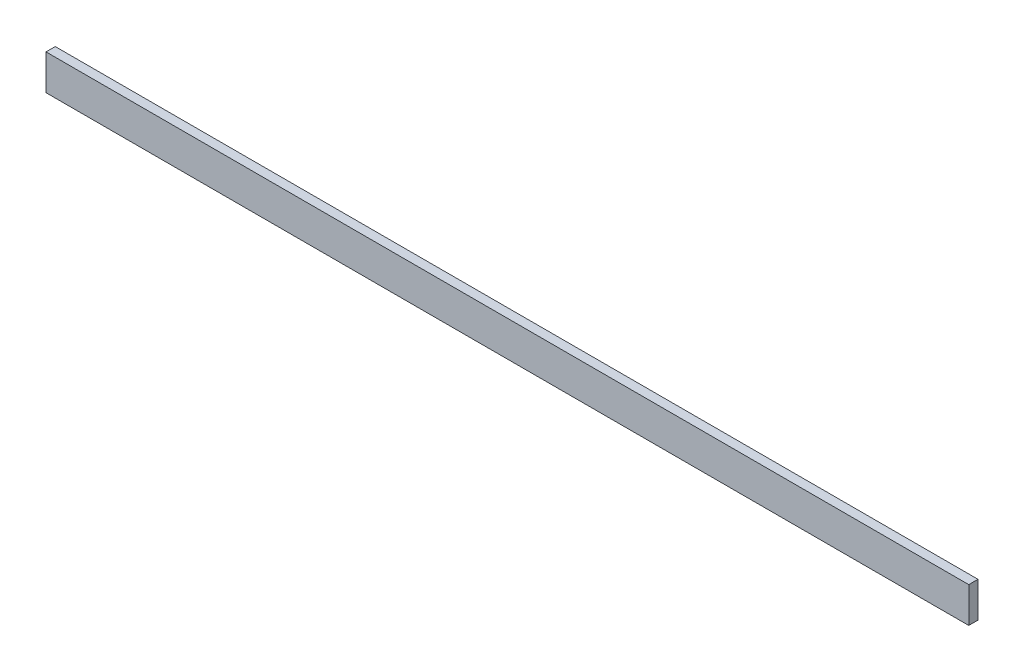
ISO-10303-21;
HEADER;
FILE_DESCRIPTION(('STEP AP214'),'2;1');
FILE_NAME('part.step','',(''),(''),'','','');
FILE_SCHEMA(('AUTOMOTIVE_DESIGN { 1 0 10303 214 1 1 1 1 }'));
ENDSEC;
DATA;
#1=APPLICATION_CONTEXT('core data for automotive mechanical design processes');
#2=APPLICATION_PROTOCOL_DEFINITION('international standard','automotive_design',2000,#1);
#3=PRODUCT_CONTEXT('',#1,'mechanical');
#4=PRODUCT('Part','Part','',(#3));
#5=PRODUCT_RELATED_PRODUCT_CATEGORY('part','',(#4));
#6=PRODUCT_DEFINITION_FORMATION('','',#4);
#7=PRODUCT_DEFINITION_CONTEXT('part definition',#1,'design');
#8=PRODUCT_DEFINITION('design','',#6,#7);
#9=PRODUCT_DEFINITION_SHAPE('','',#8);
#10=(LENGTH_UNIT() NAMED_UNIT(*) SI_UNIT(.MILLI.,.METRE.));
#11=(NAMED_UNIT(*) PLANE_ANGLE_UNIT() SI_UNIT($,.RADIAN.));
#12=(NAMED_UNIT(*) SI_UNIT($,.STERADIAN.) SOLID_ANGLE_UNIT());
#13=UNCERTAINTY_MEASURE_WITH_UNIT(LENGTH_MEASURE(1.E-05),#10,'distance_accuracy_value','');
#14=(GEOMETRIC_REPRESENTATION_CONTEXT(3) GLOBAL_UNCERTAINTY_ASSIGNED_CONTEXT((#13)) GLOBAL_UNIT_ASSIGNED_CONTEXT((#10,
#11,#12)) REPRESENTATION_CONTEXT('',''));
#15=CARTESIAN_POINT('',(0.,0.,0.));
#16=DIRECTION('',(0.,0.,1.));
#17=DIRECTION('',(1.,0.,0.));
#18=AXIS2_PLACEMENT_3D('',#15,#16,#17);
#19=CARTESIAN_POINT('',(0.,38.2926221353073,10.));
#20=DIRECTION('',(1.,0.,0.));
#21=DIRECTION('',(0.,0.,-1.));
#22=AXIS2_PLACEMENT_3D('',#19,#20,#21);
#23=PLANE('',#22);
#24=DIRECTION('',(0.,-1.,0.));
#25=VECTOR('',#24,1.);
#26=CARTESIAN_POINT('',(0.,38.2926221353073,0.));
#27=LINE('',#26,#25);
#28=CARTESIAN_POINT('',(0.,38.2926221353073,0.));
#29=VERTEX_POINT('',#28);
#30=CARTESIAN_POINT('',(0.,0.,0.));
#31=VERTEX_POINT('',#30);
#32=EDGE_CURVE('E113',#29,#31,#27,.T.);
#33=ORIENTED_EDGE('',*,*,#32,.T.);
#34=DIRECTION('',(0.,0.,-1.));
#35=VECTOR('',#34,1.);
#36=CARTESIAN_POINT('',(0.,0.,10.));
#37=LINE('',#36,#35);
#38=CARTESIAN_POINT('',(0.,0.,10.));
#39=VERTEX_POINT('',#38);
#40=EDGE_CURVE('E11',#39,#31,#37,.T.);
#41=ORIENTED_EDGE('',*,*,#40,.F.);
#42=DIRECTION('',(0.,-1.,0.));
#43=VECTOR('',#42,1.);
#44=CARTESIAN_POINT('',(0.,38.2926221353073,10.));
#45=LINE('',#44,#43);
#46=CARTESIAN_POINT('',(0.,38.2926221353073,10.));
#47=VERTEX_POINT('',#46);
#48=EDGE_CURVE('E97',#47,#39,#45,.T.);
#49=ORIENTED_EDGE('',*,*,#48,.F.);
#50=DIRECTION('',(0.,0.,-1.));
#51=VECTOR('',#50,1.);
#52=CARTESIAN_POINT('',(0.,38.2926221353073,10.));
#53=LINE('',#52,#51);
#54=EDGE_CURVE('E109',#47,#29,#53,.T.);
#55=ORIENTED_EDGE('',*,*,#54,.T.);
#56=EDGE_LOOP('',(#33,#41,#49,#55));
#57=FACE_BOUND('',#56,.T.);
#58=ADVANCED_FACE('F45',(#57),#23,.F.);
#59=CARTESIAN_POINT('',(0.,0.,10.));
#60=DIRECTION('',(0.,1.,0.));
#61=DIRECTION('',(0.,0.,1.));
#62=AXIS2_PLACEMENT_3D('',#59,#60,#61);
#63=PLANE('',#62);
#64=DIRECTION('',(1.,0.,0.));
#65=VECTOR('',#64,1.);
#66=CARTESIAN_POINT('',(0.,0.,0.));
#67=LINE('',#66,#65);
#68=CARTESIAN_POINT('',(998.757088830134,0.,0.));
#69=VERTEX_POINT('',#68);
#70=EDGE_CURVE('E102',#31,#69,#67,.T.);
#71=ORIENTED_EDGE('',*,*,#70,.T.);
#72=DIRECTION('',(0.,0.,-1.));
#73=VECTOR('',#72,1.);
#74=CARTESIAN_POINT('',(998.757088830134,0.,10.));
#75=LINE('',#74,#73);
#76=CARTESIAN_POINT('',(998.757088830134,0.,10.));
#77=VERTEX_POINT('',#76);
#78=EDGE_CURVE('E54',#77,#69,#75,.T.);
#79=ORIENTED_EDGE('',*,*,#78,.F.);
#80=DIRECTION('',(1.,0.,0.));
#81=VECTOR('',#80,1.);
#82=CARTESIAN_POINT('',(0.,0.,10.));
#83=LINE('',#82,#81);
#84=EDGE_CURVE('E92',#39,#77,#83,.T.);
#85=ORIENTED_EDGE('',*,*,#84,.F.);
#86=ORIENTED_EDGE('',*,*,#40,.T.);
#87=EDGE_LOOP('',(#71,#79,#85,#86));
#88=FACE_BOUND('',#87,.T.);
#89=ADVANCED_FACE('F101',(#88),#63,.F.);
#90=CARTESIAN_POINT('',(998.757088830134,0.,10.));
#91=DIRECTION('',(-1.,0.,0.));
#92=DIRECTION('',(0.,0.,1.));
#93=AXIS2_PLACEMENT_3D('',#90,#91,#92);
#94=PLANE('',#93);
#95=DIRECTION('',(0.,1.,0.));
#96=VECTOR('',#95,1.);
#97=CARTESIAN_POINT('',(998.757088830134,0.,0.));
#98=LINE('',#97,#96);
#99=CARTESIAN_POINT('',(998.757088830134,38.2926221353073,0.));
#100=VERTEX_POINT('',#99);
#101=EDGE_CURVE('E79',#69,#100,#98,.T.);
#102=ORIENTED_EDGE('',*,*,#101,.T.);
#103=DIRECTION('',(0.,0.,-1.));
#104=VECTOR('',#103,1.);
#105=CARTESIAN_POINT('',(998.757088830134,38.2926221353073,10.));
#106=LINE('',#105,#104);
#107=CARTESIAN_POINT('',(998.757088830134,38.2926221353073,10.));
#108=VERTEX_POINT('',#107);
#109=EDGE_CURVE('E104',#108,#100,#106,.T.);
#110=ORIENTED_EDGE('',*,*,#109,.F.);
#111=DIRECTION('',(0.,1.,0.));
#112=VECTOR('',#111,1.);
#113=CARTESIAN_POINT('',(998.757088830134,0.,10.));
#114=LINE('',#113,#112);
#115=EDGE_CURVE('E95',#77,#108,#114,.T.);
#116=ORIENTED_EDGE('',*,*,#115,.F.);
#117=ORIENTED_EDGE('',*,*,#78,.T.);
#118=EDGE_LOOP('',(#102,#110,#116,#117));
#119=FACE_BOUND('',#118,.T.);
#120=ADVANCED_FACE('F105',(#119),#94,.F.);
#121=CARTESIAN_POINT('',(998.757088830134,38.2926221353073,10.));
#122=DIRECTION('',(0.,-1.,0.));
#123=DIRECTION('',(0.,0.,-1.));
#124=AXIS2_PLACEMENT_3D('',#121,#122,#123);
#125=PLANE('',#124);
#126=DIRECTION('',(-1.,0.,0.));
#127=VECTOR('',#126,1.);
#128=CARTESIAN_POINT('',(998.757088830134,38.2926221353073,0.));
#129=LINE('',#128,#127);
#130=EDGE_CURVE('E85',#100,#29,#129,.T.);
#131=ORIENTED_EDGE('',*,*,#130,.T.);
#132=ORIENTED_EDGE('',*,*,#54,.F.);
#133=DIRECTION('',(-1.,0.,0.));
#134=VECTOR('',#133,1.);
#135=CARTESIAN_POINT('',(998.757088830134,38.2926221353073,10.));
#136=LINE('',#135,#134);
#137=EDGE_CURVE('E62',#108,#47,#136,.T.);
#138=ORIENTED_EDGE('',*,*,#137,.F.);
#139=ORIENTED_EDGE('',*,*,#109,.T.);
#140=EDGE_LOOP('',(#131,#132,#138,#139));
#141=FACE_BOUND('',#140,.T.);
#142=ADVANCED_FACE('F126',(#141),#125,.F.);
#143=CARTESIAN_POINT('',(0.,0.,10.));
#144=DIRECTION('',(0.,0.,1.));
#145=DIRECTION('',(1.,0.,0.));
#146=AXIS2_PLACEMENT_3D('',#143,#144,#145);
#147=PLANE('',#146);
#148=ORIENTED_EDGE('',*,*,#48,.T.);
#149=ORIENTED_EDGE('',*,*,#84,.T.);
#150=ORIENTED_EDGE('',*,*,#115,.T.);
#151=ORIENTED_EDGE('',*,*,#137,.T.);
#152=EDGE_LOOP('',(#148,#149,#150,#151));
#153=FACE_BOUND('',#152,.T.);
#154=ADVANCED_FACE('F93',(#153),#147,.T.);
#155=CARTESIAN_POINT('',(0.,0.,0.));
#156=DIRECTION('',(0.,0.,1.));
#157=DIRECTION('',(1.,0.,0.));
#158=AXIS2_PLACEMENT_3D('',#155,#156,#157);
#159=PLANE('',#158);
#160=ORIENTED_EDGE('',*,*,#32,.F.);
#161=ORIENTED_EDGE('',*,*,#130,.F.);
#162=ORIENTED_EDGE('',*,*,#101,.F.);
#163=ORIENTED_EDGE('',*,*,#70,.F.);
#164=EDGE_LOOP('',(#160,#161,#162,#163));
#165=FACE_BOUND('',#164,.T.);
#166=ADVANCED_FACE('F129',(#165),#159,.F.);
#167=CLOSED_SHELL('',(#58,#89,#120,#142,#154,#166));
#168=MANIFOLD_SOLID_BREP('B2',#167);
#169=ADVANCED_BREP_SHAPE_REPRESENTATION('',(#18,#168),#14);
#170=SHAPE_DEFINITION_REPRESENTATION(#9,#169);
ENDSEC;
END-ISO-10303-21;
